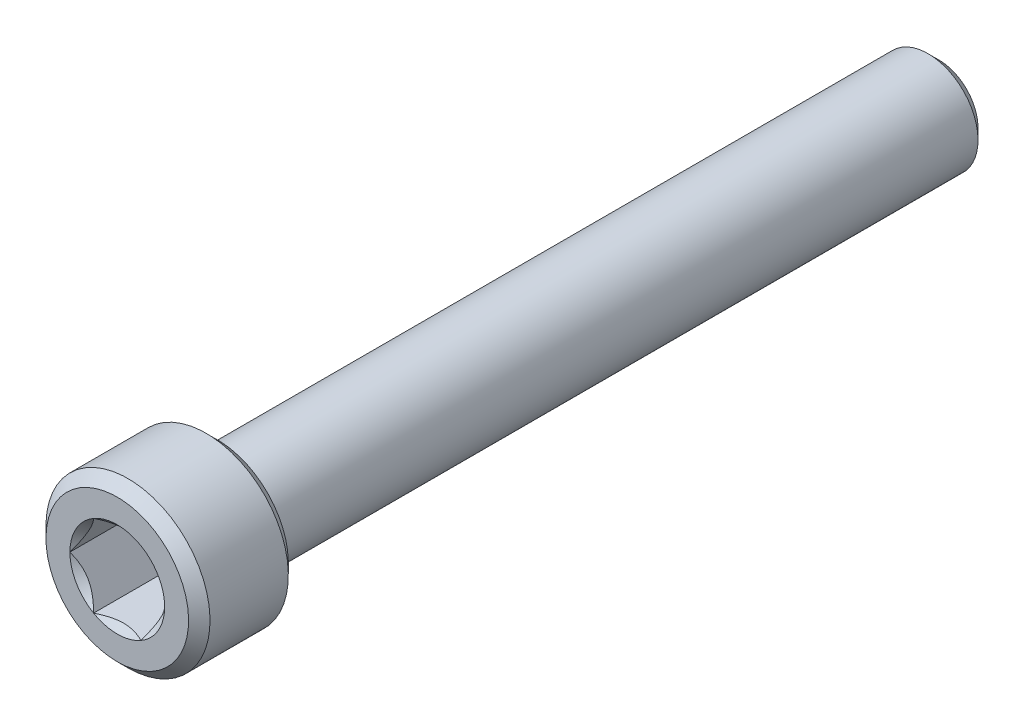
ISO-10303-21;
HEADER;
FILE_DESCRIPTION(('STEP AP214'),'2;1');
FILE_NAME('part.step','',(''),(''),'','','');
FILE_SCHEMA(('AUTOMOTIVE_DESIGN { 1 0 10303 214 1 1 1 1 }'));
ENDSEC;
DATA;
#1=APPLICATION_CONTEXT('core data for automotive mechanical design processes');
#2=APPLICATION_PROTOCOL_DEFINITION('international standard','automotive_design',2000,#1);
#3=PRODUCT_CONTEXT('',#1,'mechanical');
#4=PRODUCT('Part','Part','',(#3));
#5=PRODUCT_RELATED_PRODUCT_CATEGORY('part','',(#4));
#6=PRODUCT_DEFINITION_FORMATION('','',#4);
#7=PRODUCT_DEFINITION_CONTEXT('part definition',#1,'design');
#8=PRODUCT_DEFINITION('design','',#6,#7);
#9=PRODUCT_DEFINITION_SHAPE('','',#8);
#10=(LENGTH_UNIT() NAMED_UNIT(*) SI_UNIT(.MILLI.,.METRE.));
#11=(NAMED_UNIT(*) PLANE_ANGLE_UNIT() SI_UNIT($,.RADIAN.));
#12=(NAMED_UNIT(*) SI_UNIT($,.STERADIAN.) SOLID_ANGLE_UNIT());
#13=UNCERTAINTY_MEASURE_WITH_UNIT(LENGTH_MEASURE(1.E-05),#10,'distance_accuracy_value','');
#14=(GEOMETRIC_REPRESENTATION_CONTEXT(3) GLOBAL_UNCERTAINTY_ASSIGNED_CONTEXT((#13)) GLOBAL_UNIT_ASSIGNED_CONTEXT((#10,
#11,#12)) REPRESENTATION_CONTEXT('',''));
#15=CARTESIAN_POINT('',(0.,0.,0.));
#16=DIRECTION('',(0.,0.,1.));
#17=DIRECTION('',(1.,0.,0.));
#18=AXIS2_PLACEMENT_3D('',#15,#16,#17);
#19=CARTESIAN_POINT('',(0.,0.,14.6198166666666));
#20=DIRECTION('',(0.,0.,-1.));
#21=DIRECTION('',(0.,1.,0.));
#22=AXIS2_PLACEMENT_3D('',#19,#20,#21);
#23=CONICAL_SURFACE('',#22,3.96875,0.785398163397438);
#24=CARTESIAN_POINT('',(0.,0.,15.1384));
#25=DIRECTION('',(0.,0.,1.));
#26=DIRECTION('',(0.,-1.,0.));
#27=AXIS2_PLACEMENT_3D('',#24,#25,#26);
#28=CIRCLE('',#27,3.45016666666663);
#29=CARTESIAN_POINT('',(0.,-3.45016666666663,15.1384));
#30=VERTEX_POINT('',#29);
#31=EDGE_CURVE('E55',#30,#30,#28,.T.);
#32=ORIENTED_EDGE('',*,*,#31,.F.);
#33=EDGE_LOOP('',(#32));
#34=FACE_BOUND('',#33,.T.);
#35=CARTESIAN_POINT('',(0.,0.,14.6198166666666));
#36=DIRECTION('',(0.,0.,1.));
#37=DIRECTION('',(0.,-1.,0.));
#38=AXIS2_PLACEMENT_3D('',#35,#36,#37);
#39=CIRCLE('',#38,3.96875);
#40=CARTESIAN_POINT('',(0.,-3.96875,14.6198166666666));
#41=VERTEX_POINT('',#40);
#42=EDGE_CURVE('E154',#41,#41,#39,.T.);
#43=ORIENTED_EDGE('',*,*,#42,.T.);
#44=EDGE_LOOP('',(#43));
#45=FACE_BOUND('',#44,.T.);
#46=ADVANCED_FACE('F41',(#34,#45),#23,.T.);
#47=CARTESIAN_POINT('',(0.,3.45016666666663,15.1384));
#48=DIRECTION('',(0.,0.,-1.));
#49=DIRECTION('',(0.,1.,0.));
#50=AXIS2_PLACEMENT_3D('',#47,#48,#49);
#51=PLANE('',#50);
#52=CARTESIAN_POINT('',(0.,0.,15.1384));
#53=DIRECTION('',(0.,0.,1.));
#54=DIRECTION('',(1.,0.,0.));
#55=AXIS2_PLACEMENT_3D('',#52,#53,#54);
#56=CIRCLE('',#55,2.29135888084633);
#57=CARTESIAN_POINT('',(1.14567944042316,1.984375,15.1384));
#58=VERTEX_POINT('',#57);
#59=CARTESIAN_POINT('',(-1.14567944042316,1.984375,15.1384));
#60=VERTEX_POINT('',#59);
#61=EDGE_CURVE('E319',#58,#60,#56,.T.);
#62=ORIENTED_EDGE('',*,*,#61,.F.);
#63=CARTESIAN_POINT('',(2.29135888084633,0.,15.1384));
#64=VERTEX_POINT('',#63);
#65=EDGE_CURVE('E264',#64,#58,#56,.T.);
#66=ORIENTED_EDGE('',*,*,#65,.F.);
#67=CARTESIAN_POINT('',(1.14567944042316,-1.984375,15.1384));
#68=VERTEX_POINT('',#67);
#69=EDGE_CURVE('E61',#68,#64,#56,.T.);
#70=ORIENTED_EDGE('',*,*,#69,.F.);
#71=CARTESIAN_POINT('',(-1.14567944042317,-1.984375,15.1384));
#72=VERTEX_POINT('',#71);
#73=EDGE_CURVE('E68',#72,#68,#56,.T.);
#74=ORIENTED_EDGE('',*,*,#73,.F.);
#75=CARTESIAN_POINT('',(-2.29135888084633,0.,15.1384));
#76=VERTEX_POINT('',#75);
#77=EDGE_CURVE('E311',#76,#72,#56,.T.);
#78=ORIENTED_EDGE('',*,*,#77,.F.);
#79=EDGE_CURVE('E316',#60,#76,#56,.T.);
#80=ORIENTED_EDGE('',*,*,#79,.F.);
#81=EDGE_LOOP('',(#62,#66,#70,#74,#78,#80));
#82=FACE_BOUND('',#81,.T.);
#83=ORIENTED_EDGE('',*,*,#31,.T.);
#84=EDGE_LOOP('',(#83));
#85=FACE_BOUND('',#84,.T.);
#86=ADVANCED_FACE('F195',(#82,#85),#51,.F.);
#87=CARTESIAN_POINT('',(0.,0.,-24.6126));
#88=DIRECTION('',(0.,0.,1.));
#89=DIRECTION('',(0.,-1.,0.));
#90=AXIS2_PLACEMENT_3D('',#87,#88,#89);
#91=PLANE('',#90);
#92=CARTESIAN_POINT('',(0.,0.,-24.6126));
#93=DIRECTION('',(0.,0.,1.));
#94=DIRECTION('',(0.,-1.,0.));
#95=AXIS2_PLACEMENT_3D('',#92,#93,#94);
#96=CIRCLE('',#95,1.89441666666655);
#97=CARTESIAN_POINT('',(0.,-1.89441666666655,-24.6126));
#98=VERTEX_POINT('',#97);
#99=EDGE_CURVE('E188',#98,#98,#96,.T.);
#100=ORIENTED_EDGE('',*,*,#99,.F.);
#101=EDGE_LOOP('',(#100));
#102=FACE_BOUND('',#101,.T.);
#103=ADVANCED_FACE('F229',(#102),#91,.F.);
#104=CARTESIAN_POINT('',(0.,0.,-24.6126));
#105=DIRECTION('',(0.,0.,1.));
#106=DIRECTION('',(0.,-1.,0.));
#107=AXIS2_PLACEMENT_3D('',#104,#105,#106);
#108=CONICAL_SURFACE('',#107,1.89441666666655,0.785398163397442);
#109=CARTESIAN_POINT('',(0.,0.,-24.0940166666666));
#110=DIRECTION('',(0.,0.,1.));
#111=DIRECTION('',(0.,-1.,0.));
#112=AXIS2_PLACEMENT_3D('',#109,#110,#111);
#113=CIRCLE('',#112,2.41299999999991);
#114=CARTESIAN_POINT('',(0.,-2.41299999999991,-24.0940166666666));
#115=VERTEX_POINT('',#114);
#116=EDGE_CURVE('E184',#115,#115,#113,.T.);
#117=ORIENTED_EDGE('',*,*,#116,.F.);
#118=EDGE_LOOP('',(#117));
#119=FACE_BOUND('',#118,.T.);
#120=ORIENTED_EDGE('',*,*,#99,.T.);
#121=EDGE_LOOP('',(#120));
#122=FACE_BOUND('',#121,.T.);
#123=ADVANCED_FACE('F223',(#119,#122),#108,.T.);
#124=CARTESIAN_POINT('',(0.,0.,10.3124));
#125=DIRECTION('',(0.,0.,1.));
#126=DIRECTION('',(0.,-1.,0.));
#127=AXIS2_PLACEMENT_3D('',#124,#125,#126);
#128=CYLINDRICAL_SURFACE('',#127,2.4129999999999);
#129=CARTESIAN_POINT('',(0.,0.,10.3124));
#130=DIRECTION('',(0.,0.,1.));
#131=DIRECTION('',(0.,-1.,0.));
#132=AXIS2_PLACEMENT_3D('',#129,#130,#131);
#133=CIRCLE('',#132,2.4129999999999);
#134=CARTESIAN_POINT('',(0.,-2.4129999999999,10.3124));
#135=VERTEX_POINT('',#134);
#136=EDGE_CURVE('E180',#135,#135,#133,.T.);
#137=ORIENTED_EDGE('',*,*,#136,.F.);
#138=EDGE_LOOP('',(#137));
#139=FACE_BOUND('',#138,.T.);
#140=ORIENTED_EDGE('',*,*,#116,.T.);
#141=EDGE_LOOP('',(#140));
#142=FACE_BOUND('',#141,.T.);
#143=ADVANCED_FACE('F217',(#139,#142),#128,.T.);
#144=CARTESIAN_POINT('',(0.,3.45016666666667,10.3124));
#145=DIRECTION('',(0.,0.,1.));
#146=DIRECTION('',(0.,-1.,0.));
#147=AXIS2_PLACEMENT_3D('',#144,#145,#146);
#148=PLANE('',#147);
#149=CARTESIAN_POINT('',(0.,0.,10.3124));
#150=DIRECTION('',(0.,0.,1.));
#151=DIRECTION('',(0.,-1.,0.));
#152=AXIS2_PLACEMENT_3D('',#149,#150,#151);
#153=CIRCLE('',#152,3.45016666666667);
#154=CARTESIAN_POINT('',(0.,-3.45016666666667,10.3124));
#155=VERTEX_POINT('',#154);
#156=EDGE_CURVE('E176',#155,#155,#153,.T.);
#157=ORIENTED_EDGE('',*,*,#156,.F.);
#158=EDGE_LOOP('',(#157));
#159=FACE_BOUND('',#158,.T.);
#160=ORIENTED_EDGE('',*,*,#136,.T.);
#161=EDGE_LOOP('',(#160));
#162=FACE_BOUND('',#161,.T.);
#163=ADVANCED_FACE('F211',(#159,#162),#148,.F.);
#164=CARTESIAN_POINT('',(0.,0.,10.3124));
#165=DIRECTION('',(0.,0.,1.));
#166=DIRECTION('',(0.,-1.,0.));
#167=AXIS2_PLACEMENT_3D('',#164,#165,#166);
#168=CONICAL_SURFACE('',#167,3.45016666666667,0.785398163397409);
#169=CARTESIAN_POINT('',(0.,0.,10.8309833333334));
#170=DIRECTION('',(0.,0.,1.));
#171=DIRECTION('',(0.,-1.,0.));
#172=AXIS2_PLACEMENT_3D('',#169,#170,#171);
#173=CIRCLE('',#172,3.96875);
#174=CARTESIAN_POINT('',(0.,-3.96875,10.8309833333334));
#175=VERTEX_POINT('',#174);
#176=EDGE_CURVE('E172',#175,#175,#173,.T.);
#177=ORIENTED_EDGE('',*,*,#176,.F.);
#178=EDGE_LOOP('',(#177));
#179=FACE_BOUND('',#178,.T.);
#180=ORIENTED_EDGE('',*,*,#156,.T.);
#181=EDGE_LOOP('',(#180));
#182=FACE_BOUND('',#181,.T.);
#183=ADVANCED_FACE('F205',(#179,#182),#168,.T.);
#184=CARTESIAN_POINT('',(0.,0.,10.3124));
#185=DIRECTION('',(0.,0.,1.));
#186=DIRECTION('',(0.,-1.,0.));
#187=AXIS2_PLACEMENT_3D('',#184,#185,#186);
#188=CYLINDRICAL_SURFACE('',#187,3.96875);
#189=ORIENTED_EDGE('',*,*,#42,.F.);
#190=EDGE_LOOP('',(#189));
#191=FACE_BOUND('',#190,.T.);
#192=ORIENTED_EDGE('',*,*,#176,.T.);
#193=EDGE_LOOP('',(#192));
#194=FACE_BOUND('',#193,.T.);
#195=ADVANCED_FACE('F201',(#191,#194),#188,.T.);
#196=CARTESIAN_POINT('',(0.,0.,15.1384));
#197=DIRECTION('',(0.,0.,1.));
#198=DIRECTION('',(1.,0.,0.));
#199=AXIS2_PLACEMENT_3D('',#196,#197,#198);
#200=CONICAL_SURFACE('',#199,2.29135888084633,0.78539816339745);
#201=ORIENTED_EDGE('',*,*,#61,.T.);
#202=CARTESIAN_POINT('',(-2.28495242157822,1.984375,15.8733840788166));
#203=CARTESIAN_POINT('',(-2.22931635455402,1.984375,15.8313866855508));
#204=CARTESIAN_POINT('',(-2.17336876548389,1.984375,15.7897960540763));
#205=CARTESIAN_POINT('',(-2.06072770258171,1.984375,15.7076084614715));
#206=CARTESIAN_POINT('',(-2.00403404503435,1.984375,15.667011752405));
#207=CARTESIAN_POINT('',(-1.88936329173488,1.984375,15.5867035031747));
#208=CARTESIAN_POINT('',(-1.83137965519348,1.984375,15.5470012588133));
#209=CARTESIAN_POINT('',(-1.7144280213784,1.984375,15.4690851734013));
#210=CARTESIAN_POINT('',(-1.65546009407227,1.984375,15.4308712271944));
#211=CARTESIAN_POINT('',(-1.47005472306035,1.984375,15.3146528340136));
#212=CARTESIAN_POINT('',(-1.34163909427883,1.984375,15.2397478868724));
#213=CARTESIAN_POINT('',(-1.0784038470548,1.984375,15.1027302154397));
#214=CARTESIAN_POINT('',(-0.943607781407425,1.984375,15.0405743664824));
#215=CARTESIAN_POINT('',(-0.741275100444882,1.984375,14.9645325786886));
#216=CARTESIAN_POINT('',(-0.676735408881095,1.984375,14.942708061326));
#217=CARTESIAN_POINT('',(-0.546098118112762,1.984375,14.9042404635378));
#218=CARTESIAN_POINT('',(-0.480000411919956,1.984375,14.8875977400655));
#219=CARTESIAN_POINT('',(-0.347746170028532,1.984375,14.8606353808697));
#220=CARTESIAN_POINT('',(-0.281612071479123,1.984375,14.8502074097359));
#221=CARTESIAN_POINT('',(-0.148636620052351,1.984375,14.8358781473766));
#222=CARTESIAN_POINT('',(-0.0817953907393243,1.984375,14.8319757342274));
#223=CARTESIAN_POINT('',(0.0495156750890641,1.984375,14.8309870513327));
#224=CARTESIAN_POINT('',(0.113983775102991,1.984375,14.833659178875));
#225=CARTESIAN_POINT('',(0.242367515846177,1.984375,14.8451392104975));
#226=CARTESIAN_POINT('',(0.306283102295919,1.984375,14.8539477106392));
#227=CARTESIAN_POINT('',(0.434181040262184,1.984375,14.8773690213329));
#228=CARTESIAN_POINT('',(0.498145026858309,1.984375,14.8920806062321));
#229=CARTESIAN_POINT('',(0.624675616953007,1.984375,14.9265261814121));
#230=CARTESIAN_POINT('',(0.687242336899688,1.984375,14.9462597514492));
#231=CARTESIAN_POINT('',(0.884225483826088,1.984375,15.0158122372308));
#232=CARTESIAN_POINT('',(1.01583674256468,1.984375,15.0735524112565));
#233=CARTESIAN_POINT('',(1.27288659242652,1.984375,15.2019303365888));
#234=CARTESIAN_POINT('',(1.3983008827048,1.984375,15.2726144249194));
#235=CARTESIAN_POINT('',(1.57956687990221,1.984375,15.3829166638132));
#236=CARTESIAN_POINT('',(1.63738271299424,1.984375,15.4193698294754));
#237=CARTESIAN_POINT('',(1.75202215386202,1.984375,15.4938159632917));
#238=CARTESIAN_POINT('',(1.80884568601362,1.984375,15.5318090480781));
#239=CARTESIAN_POINT('',(1.92116923084255,1.984375,15.6087388088931));
#240=CARTESIAN_POINT('',(1.97667624512253,1.984375,15.6476653130388));
#241=CARTESIAN_POINT('',(2.08693170717166,1.984375,15.7265477461214));
#242=CARTESIAN_POINT('',(2.14168035934793,1.984375,15.766503389024));
#243=CARTESIAN_POINT('',(2.19611149046622,1.984375,15.8068806112854));
#244=B_SPLINE_CURVE_WITH_KNOTS('',3,(#202,#203,#204,#205,#206,#207,#208,#209,#210,#211,#212,
#213,#214,#215,#216,#217,#218,#219,#220,#221,#222,#223,#224,#225,#226,#227,#228,#229,#230,#231,
#232,#233,#234,#235,#236,#237,#238,#239,#240,#241,#242,#243),.UNSPECIFIED.,.F.,.F.,(4,2,2,2,2,2,
2,2,2,2,2,2,2,2,2,2,2,2,2,2,4),(0.,0.209126070008323,0.418304637356568,0.629103979977991,
0.839888401371184,1.28549951116127,1.72957750768351,1.93379389749971,2.13802435186698,
2.33858179514333,2.53910475350639,2.73236963400794,2.92565329006886,3.12231577097487,
3.31896180041345,3.74886295245172,4.18033428125362,4.3853601718029,4.59040161996382,
4.79377749165107,4.99709743524131),.UNSPECIFIED.);
#245=EDGE_CURVE('E11',#58,#60,#244,.F.);
#246=ORIENTED_EDGE('',*,*,#245,.F.);
#247=EDGE_LOOP('',(#201,#246));
#248=FACE_BOUND('',#247,.T.);
#249=ADVANCED_FACE('F204',(#248),#200,.F.);
#250=ORIENTED_EDGE('',*,*,#79,.T.);
#251=CARTESIAN_POINT('',(-1.14556397036933,1.984575,15.1385154787818));
#252=CARTESIAN_POINT('',(-1.18494849354192,1.9163590048332,15.0991628522639));
#253=CARTESIAN_POINT('',(-1.22499159714897,1.84700231489304,15.0621213104462));
#254=CARTESIAN_POINT('',(-1.30664400291398,1.70557619954781,14.9942988584233));
#255=CARTESIAN_POINT('',(-1.34826107209555,1.63349332126322,14.9635556890918));
#256=CARTESIAN_POINT('',(-1.43217992591557,1.488141602734,14.9108918888112));
#257=CARTESIAN_POINT('',(-1.47446033414662,1.41490978751306,14.88883887588));
#258=CARTESIAN_POINT('',(-1.55995203534886,1.2668338174053,14.8548614929439));
#259=CARTESIAN_POINT('',(-1.60316071596705,1.19199418724658,14.8429117560917));
#260=CARTESIAN_POINT('',(-1.6776271237807,1.06301458545619,14.8321300990819));
#261=CARTESIAN_POINT('',(-1.7087886237741,1.00904128422756,14.8305338990591));
#262=CARTESIAN_POINT('',(-1.77106070163465,0.901182881480202,14.8332218388653));
#263=CARTESIAN_POINT('',(-1.80217125782056,0.847297817514479,14.8375080403405));
#264=CARTESIAN_POINT('',(-1.86409863044402,0.740036461751399,14.8517168730135));
#265=CARTESIAN_POINT('',(-1.89491507894443,0.686660807239862,14.8616458104523));
#266=CARTESIAN_POINT('',(-1.95601509066827,0.580832482591106,14.8865950842745));
#267=CARTESIAN_POINT('',(-1.9862986945516,0.528379742028901,14.9016150303895));
#268=CARTESIAN_POINT('',(-2.06387267818152,0.394017661036354,14.9462078516357));
#269=CARTESIAN_POINT('',(-2.11068193911104,0.312941642841678,14.9791429959383));
#270=CARTESIAN_POINT('',(-2.17951072233758,0.193726693270161,15.0347424412022));
#271=CARTESIAN_POINT('',(-2.20219286161692,0.154440075613999,15.0542775920519));
#272=CARTESIAN_POINT('',(-2.24713694590237,0.0765946381319467,15.0951287381194));
#273=CARTESIAN_POINT('',(-2.26939913882716,0.0380353888983009,15.1164436395683));
#274=CARTESIAN_POINT('',(-2.29147435090017,-0.000200000000000228,15.1385154787818));
#275=B_SPLINE_CURVE_WITH_KNOTS('',3,(#251,#252,#253,#254,#255,#256,#257,#258,#259,#260,#261,
#262,#263,#264,#265,#266,#267,#268,#269,#270,#271,#272,#273,#274),.UNSPECIFIED.,.F.,.F.,(4,2,2,
2,2,2,2,2,2,2,2,4),(0.,0.264339630306625,0.530219665093692,0.791876416371458,1.05287424418109,
1.239639843932,1.42647091743852,1.61351120244034,1.8005371524754,2.09764209964316,
2.24579179873714,2.39385111134157),.UNSPECIFIED.);
#276=EDGE_CURVE('E254',#60,#76,#275,.T.);
#277=ORIENTED_EDGE('',*,*,#276,.F.);
#278=EDGE_LOOP('',(#250,#277));
#279=FACE_BOUND('',#278,.T.);
#280=ADVANCED_FACE('F326',(#279),#200,.F.);
#281=ORIENTED_EDGE('',*,*,#77,.T.);
#282=CARTESIAN_POINT('',(-2.29147435090017,0.000200000000000176,15.1385154787818));
#283=CARTESIAN_POINT('',(-2.25208982772758,-0.0680159951668019,15.0991628522639));
#284=CARTESIAN_POINT('',(-2.21204672412052,-0.137372685106965,15.0621213104462));
#285=CARTESIAN_POINT('',(-2.13039431835551,-0.278798800452187,14.9942988584233));
#286=CARTESIAN_POINT('',(-2.08877724917394,-0.350881678736782,14.9635556890918));
#287=CARTESIAN_POINT('',(-2.00485839535392,-0.496233397266004,14.9108918888112));
#288=CARTESIAN_POINT('',(-1.96257798712287,-0.569465212486938,14.88883887588));
#289=CARTESIAN_POINT('',(-1.87708628592063,-0.717541182594706,14.8548614929439));
#290=CARTESIAN_POINT('',(-1.83387760530244,-0.792380812753424,14.8429117560917));
#291=CARTESIAN_POINT('',(-1.75941119748879,-0.921360414543815,14.8321300990819));
#292=CARTESIAN_POINT('',(-1.72824969749539,-0.975333715772442,14.8305338990591));
#293=CARTESIAN_POINT('',(-1.66597761963484,-1.0831921185198,14.8332218388653));
#294=CARTESIAN_POINT('',(-1.63486706344893,-1.13707718248552,14.8375080403405));
#295=CARTESIAN_POINT('',(-1.57293969082547,-1.2443385382486,14.8517168730135));
#296=CARTESIAN_POINT('',(-1.54212324232506,-1.29771419276014,14.8616458104523));
#297=CARTESIAN_POINT('',(-1.48102323060122,-1.4035425174089,14.8865950842745));
#298=CARTESIAN_POINT('',(-1.4507396267179,-1.4559952579711,14.9016150303895));
#299=CARTESIAN_POINT('',(-1.37316564308797,-1.59035733896365,14.9462078516357));
#300=CARTESIAN_POINT('',(-1.32635638215845,-1.67143335715832,14.9791429959383));
#301=CARTESIAN_POINT('',(-1.25752759893191,-1.79064830672984,15.0347424412022));
#302=CARTESIAN_POINT('',(-1.23484545965257,-1.829934924386,15.0542775920519));
#303=CARTESIAN_POINT('',(-1.18990137536713,-1.90778036186805,15.0951287381194));
#304=CARTESIAN_POINT('',(-1.16763918244233,-1.9463396111017,15.1164436395683));
#305=CARTESIAN_POINT('',(-1.14556397036933,-1.984575,15.1385154787818));
#306=B_SPLINE_CURVE_WITH_KNOTS('',3,(#282,#283,#284,#285,#286,#287,#288,#289,#290,#291,#292,
#293,#294,#295,#296,#297,#298,#299,#300,#301,#302,#303,#304,#305),.UNSPECIFIED.,.F.,.F.,(4,2,2,
2,2,2,2,2,2,2,2,4),(0.,0.264339630306626,0.530219665093694,0.79187641637146,1.05287424418109,
1.239639843932,1.42647091743852,1.61351120244035,1.8005371524754,2.09764209964316,
2.24579179873714,2.39385111134157),.UNSPECIFIED.);
#307=EDGE_CURVE('E263',#76,#72,#306,.T.);
#308=ORIENTED_EDGE('',*,*,#307,.F.);
#309=EDGE_LOOP('',(#281,#308));
#310=FACE_BOUND('',#309,.T.);
#311=ADVANCED_FACE('F328',(#310),#200,.F.);
#312=ORIENTED_EDGE('',*,*,#73,.T.);
#313=CARTESIAN_POINT('',(-2.28495242191068,-1.984375,15.8733840790676));
#314=CARTESIAN_POINT('',(-2.22931635487714,-1.984375,15.8313866857921));
#315=CARTESIAN_POINT('',(-2.17336876579766,-1.984375,15.789796054308));
#316=CARTESIAN_POINT('',(-2.06072770287667,-1.984375,15.7076084616839));
#317=CARTESIAN_POINT('',(-2.00403404531986,-1.984375,15.6670117526079));
#318=CARTESIAN_POINT('',(-1.88936329200117,-1.984375,15.5867035033582));
#319=CARTESIAN_POINT('',(-1.83137965544999,-1.984375,15.5470012589872));
#320=CARTESIAN_POINT('',(-1.71442802161519,-1.984375,15.469085173556));
#321=CARTESIAN_POINT('',(-1.65546009429911,-1.984375,15.4308712273396));
#322=CARTESIAN_POINT('',(-1.47005472325436,-1.984375,15.3146528341287));
#323=CARTESIAN_POINT('',(-1.3416390944495,-1.984375,15.2397478869673));
#324=CARTESIAN_POINT('',(-1.07840384717679,-1.984375,15.1027302154972));
#325=CARTESIAN_POINT('',(-0.943607781504099,-1.984375,15.0405743665226));
#326=CARTESIAN_POINT('',(-0.74127510052251,-1.984375,14.964532578716));
#327=CARTESIAN_POINT('',(-0.676735408966699,-1.984375,14.9427080613539));
#328=CARTESIAN_POINT('',(-0.546098118214577,-1.984375,14.9042404635651));
#329=CARTESIAN_POINT('',(-0.480000412030008,-1.984375,14.8875977400917));
#330=CARTESIAN_POINT('',(-0.347746170154786,-1.984375,14.8606353808918));
#331=CARTESIAN_POINT('',(-0.281612071613337,-1.984375,14.850207409755));
#332=CARTESIAN_POINT('',(-0.14863662020222,-1.984375,14.8358781473881));
#333=CARTESIAN_POINT('',(-0.0817953908968883,-1.984375,14.8319757342341));
#334=CARTESIAN_POINT('',(0.049515674917303,-1.984375,14.8309870513286));
#335=CARTESIAN_POINT('',(0.113983774924708,-1.984375,14.833659178865));
#336=CARTESIAN_POINT('',(0.242367515655502,-1.984375,14.8451392104746));
#337=CARTESIAN_POINT('',(0.306283102099375,-1.984375,14.8539477106093));
#338=CARTESIAN_POINT('',(0.434181040054052,-1.984375,14.8773690212885));
#339=CARTESIAN_POINT('',(0.498145026644477,-1.984375,14.8920806061801));
#340=CARTESIAN_POINT('',(0.624675616728325,-1.984375,14.9265261813447));
#341=CARTESIAN_POINT('',(0.687242336669856,-1.984375,14.946259751374));
#342=CARTESIAN_POINT('',(0.88422548354621,-1.984375,15.0158122371188));
#343=CARTESIAN_POINT('',(1.01583674224241,-1.984375,15.0735524111108));
#344=CARTESIAN_POINT('',(1.27288659202273,-1.984375,15.2019303363718));
#345=CARTESIAN_POINT('',(1.3983008822619,-1.984375,15.2726144246649));
#346=CARTESIAN_POINT('',(1.57956687940503,-1.984375,15.3829166635036));
#347=CARTESIAN_POINT('',(1.63738271248118,-1.984375,15.4193698291489));
#348=CARTESIAN_POINT('',(1.75202215331741,-1.984375,15.4938159629313));
#349=CARTESIAN_POINT('',(1.80884568545336,-1.984375,15.5318090477007));
#350=CARTESIAN_POINT('',(1.92116923025136,-1.984375,15.6087388084819));
#351=CARTESIAN_POINT('',(1.97667624451606,-1.984375,15.6476653126108));
#352=CARTESIAN_POINT('',(2.08693170653472,-1.984375,15.7265477456598));
#353=CARTESIAN_POINT('',(2.1416803586958,-1.984375,15.7665033885457));
#354=CARTESIAN_POINT('',(2.19611148979895,-1.984375,15.8068806107903));
#355=B_SPLINE_CURVE_WITH_KNOTS('',3,(#313,#314,#315,#316,#317,#318,#319,#320,#321,#322,#323,
#324,#325,#326,#327,#328,#329,#330,#331,#332,#333,#334,#335,#336,#337,#338,#339,#340,#341,#342,
#343,#344,#345,#346,#347,#348,#349,#350,#351,#352,#353,#354),.UNSPECIFIED.,.F.,.F.,(4,2,2,2,2,2,
2,2,2,2,2,2,2,2,2,2,2,2,2,2,4),(0.,0.209126070048126,0.418304637436192,0.629103980098179,
0.839888401531931,1.28549951141299,1.72957750802534,1.93379389781848,2.13802435216272,
2.33858179541699,2.53910475375796,2.7323696342393,2.92565329027999,3.12231577116422,
3.31896180058103,3.74886295246281,4.18033428110719,4.38536017158909,4.59040161968262,
4.7937774913034,4.99709743482717),.UNSPECIFIED.);
#356=EDGE_CURVE('E282',#72,#68,#355,.T.);
#357=ORIENTED_EDGE('',*,*,#356,.F.);
#358=EDGE_LOOP('',(#312,#357));
#359=FACE_BOUND('',#358,.T.);
#360=ADVANCED_FACE('F331',(#359),#200,.F.);
#361=ORIENTED_EDGE('',*,*,#69,.T.);
#362=CARTESIAN_POINT('',(1.14556397036932,-1.984575,15.1385154787818));
#363=CARTESIAN_POINT('',(1.18494849354192,-1.9163590048332,15.0991628522639));
#364=CARTESIAN_POINT('',(1.22499159714897,-1.84700231489303,15.0621213104462));
#365=CARTESIAN_POINT('',(1.30664400291398,-1.70557619954781,14.9942988584233));
#366=CARTESIAN_POINT('',(1.34826107209555,-1.63349332126322,14.9635556890917));
#367=CARTESIAN_POINT('',(1.43217992591557,-1.488141602734,14.9108918888112));
#368=CARTESIAN_POINT('',(1.47446033414662,-1.41490978751306,14.88883887588));
#369=CARTESIAN_POINT('',(1.55995203534886,-1.2668338174053,14.8548614929439));
#370=CARTESIAN_POINT('',(1.60316071596705,-1.19199418724658,14.8429117560917));
#371=CARTESIAN_POINT('',(1.6776271237807,-1.06301458545619,14.8321300990819));
#372=CARTESIAN_POINT('',(1.7087886237741,-1.00904128422756,14.8305338990591));
#373=CARTESIAN_POINT('',(1.77106070163465,-0.901182881480202,14.8332218388653));
#374=CARTESIAN_POINT('',(1.80217125782056,-0.847297817514479,14.8375080403405));
#375=CARTESIAN_POINT('',(1.86409863044402,-0.740036461751399,14.8517168730135));
#376=CARTESIAN_POINT('',(1.89491507894443,-0.686660807239863,14.8616458104523));
#377=CARTESIAN_POINT('',(1.95601509066827,-0.580832482591107,14.8865950842745));
#378=CARTESIAN_POINT('',(1.9862986945516,-0.528379742028901,14.9016150303895));
#379=CARTESIAN_POINT('',(2.06387267818152,-0.394017661036354,14.9462078516357));
#380=CARTESIAN_POINT('',(2.11068193911104,-0.312941642841678,14.9791429959383));
#381=CARTESIAN_POINT('',(2.17951072233758,-0.193726693270162,15.0347424412022));
#382=CARTESIAN_POINT('',(2.20219286161692,-0.154440075614,15.0542775920519));
#383=CARTESIAN_POINT('',(2.24713694590237,-0.0765946381319474,15.0951287381194));
#384=CARTESIAN_POINT('',(2.26939913882716,-0.0380353888983016,15.1164436395683));
#385=CARTESIAN_POINT('',(2.29147435090017,0.000199999999999533,15.1385154787818));
#386=B_SPLINE_CURVE_WITH_KNOTS('',3,(#362,#363,#364,#365,#366,#367,#368,#369,#370,#371,#372,
#373,#374,#375,#376,#377,#378,#379,#380,#381,#382,#383,#384,#385),.UNSPECIFIED.,.F.,.F.,(4,2,2,
2,2,2,2,2,2,2,2,4),(0.,0.264339630306626,0.530219665093694,0.79187641637146,1.05287424418109,
1.239639843932,1.42647091743852,1.61351120244034,1.8005371524754,2.09764209964316,
2.24579179873714,2.39385111134157),.UNSPECIFIED.);
#387=EDGE_CURVE('E131',#68,#64,#386,.T.);
#388=ORIENTED_EDGE('',*,*,#387,.F.);
#389=EDGE_LOOP('',(#361,#388));
#390=FACE_BOUND('',#389,.T.);
#391=ADVANCED_FACE('F274',(#390),#200,.F.);
#392=ORIENTED_EDGE('',*,*,#65,.T.);
#393=CARTESIAN_POINT('',(2.29147435090017,-0.000200000000000406,15.1385154787818));
#394=CARTESIAN_POINT('',(2.25208982772757,0.0680159951668017,15.0991628522639));
#395=CARTESIAN_POINT('',(2.21204672412052,0.137372685106965,15.0621213104462));
#396=CARTESIAN_POINT('',(2.13039431835551,0.278798800452187,14.9942988584233));
#397=CARTESIAN_POINT('',(2.08877724917394,0.350881678736782,14.9635556890918));
#398=CARTESIAN_POINT('',(2.00485839535392,0.496233397266003,14.9108918888112));
#399=CARTESIAN_POINT('',(1.96257798712287,0.569465212486938,14.88883887588));
#400=CARTESIAN_POINT('',(1.87708628592063,0.717541182594706,14.8548614929439));
#401=CARTESIAN_POINT('',(1.83387760530244,0.792380812753424,14.8429117560917));
#402=CARTESIAN_POINT('',(1.75941119748879,0.921360414543816,14.8321300990819));
#403=CARTESIAN_POINT('',(1.72824969749539,0.975333715772442,14.8305338990591));
#404=CARTESIAN_POINT('',(1.66597761963484,1.0831921185198,14.8332218388653));
#405=CARTESIAN_POINT('',(1.63486706344893,1.13707718248552,14.8375080403405));
#406=CARTESIAN_POINT('',(1.57293969082547,1.2443385382486,14.8517168730135));
#407=CARTESIAN_POINT('',(1.54212324232506,1.29771419276014,14.8616458104523));
#408=CARTESIAN_POINT('',(1.48102323060122,1.4035425174089,14.8865950842745));
#409=CARTESIAN_POINT('',(1.45073962671789,1.4559952579711,14.9016150303895));
#410=CARTESIAN_POINT('',(1.37316564308797,1.59035733896365,14.9462078516357));
#411=CARTESIAN_POINT('',(1.32635638215845,1.67143335715832,14.9791429959383));
#412=CARTESIAN_POINT('',(1.25752759893191,1.79064830672984,15.0347424412022));
#413=CARTESIAN_POINT('',(1.23484545965257,1.829934924386,15.0542775920519));
#414=CARTESIAN_POINT('',(1.18990137536712,1.90778036186805,15.0951287381194));
#415=CARTESIAN_POINT('',(1.16763918244233,1.9463396111017,15.1164436395683));
#416=CARTESIAN_POINT('',(1.14556397036933,1.984575,15.1385154787818));
#417=B_SPLINE_CURVE_WITH_KNOTS('',3,(#393,#394,#395,#396,#397,#398,#399,#400,#401,#402,#403,
#404,#405,#406,#407,#408,#409,#410,#411,#412,#413,#414,#415,#416),.UNSPECIFIED.,.F.,.F.,(4,2,2,
2,2,2,2,2,2,2,2,4),(0.,0.264339630306627,0.530219665093694,0.791876416371461,1.05287424418109,
1.239639843932,1.42647091743852,1.61351120244035,1.8005371524754,2.09764209964316,
2.24579179873714,2.39385111134157),.UNSPECIFIED.);
#418=EDGE_CURVE('E108',#64,#58,#417,.T.);
#419=ORIENTED_EDGE('',*,*,#418,.F.);
#420=EDGE_LOOP('',(#392,#419));
#421=FACE_BOUND('',#420,.T.);
#422=ADVANCED_FACE('F270',(#421),#200,.F.);
#423=CARTESIAN_POINT('',(0.,0.,11.5189));
#424=DIRECTION('',(0.,0.,1.));
#425=DIRECTION('',(1.,0.,0.));
#426=AXIS2_PLACEMENT_3D('',#423,#424,#425);
#427=PLANE('',#426);
#428=DIRECTION('',(-0.5,0.866025403784438,0.));
#429=VECTOR('',#428,1.);
#430=CARTESIAN_POINT('',(2.29135888084633,0.,11.5189));
#431=LINE('',#430,#429);
#432=CARTESIAN_POINT('',(2.29135888084633,0.,11.5189));
#433=VERTEX_POINT('',#432);
#434=CARTESIAN_POINT('',(1.14567944042316,1.984375,11.5189));
#435=VERTEX_POINT('',#434);
#436=EDGE_CURVE('E106',#433,#435,#431,.T.);
#437=ORIENTED_EDGE('',*,*,#436,.T.);
#438=DIRECTION('',(-1.,0.,0.));
#439=VECTOR('',#438,1.);
#440=CARTESIAN_POINT('',(1.14567944042316,1.984375,11.5189));
#441=LINE('',#440,#439);
#442=CARTESIAN_POINT('',(-1.14567944042316,1.984375,11.5189));
#443=VERTEX_POINT('',#442);
#444=EDGE_CURVE('E116',#435,#443,#441,.T.);
#445=ORIENTED_EDGE('',*,*,#444,.T.);
#446=DIRECTION('',(-0.5,-0.866025403784438,0.));
#447=VECTOR('',#446,1.);
#448=CARTESIAN_POINT('',(-1.14567944042316,1.984375,11.5189));
#449=LINE('',#448,#447);
#450=CARTESIAN_POINT('',(-2.29135888084633,0.,11.5189));
#451=VERTEX_POINT('',#450);
#452=EDGE_CURVE('E123',#443,#451,#449,.T.);
#453=ORIENTED_EDGE('',*,*,#452,.T.);
#454=DIRECTION('',(0.5,-0.866025403784439,0.));
#455=VECTOR('',#454,1.);
#456=CARTESIAN_POINT('',(-2.29135888084633,0.,11.5189));
#457=LINE('',#456,#455);
#458=CARTESIAN_POINT('',(-1.14567944042317,-1.984375,11.5189));
#459=VERTEX_POINT('',#458);
#460=EDGE_CURVE('E142',#451,#459,#457,.T.);
#461=ORIENTED_EDGE('',*,*,#460,.T.);
#462=DIRECTION('',(1.,0.,0.));
#463=VECTOR('',#462,1.);
#464=CARTESIAN_POINT('',(-1.14567944042317,-1.984375,11.5189));
#465=LINE('',#464,#463);
#466=CARTESIAN_POINT('',(1.14567944042316,-1.984375,11.5189));
#467=VERTEX_POINT('',#466);
#468=EDGE_CURVE('E146',#459,#467,#465,.T.);
#469=ORIENTED_EDGE('',*,*,#468,.T.);
#470=DIRECTION('',(0.500000000000001,0.866025403784438,0.));
#471=VECTOR('',#470,1.);
#472=CARTESIAN_POINT('',(1.14567944042316,-1.984375,11.5189));
#473=LINE('',#472,#471);
#474=EDGE_CURVE('E113',#467,#433,#473,.T.);
#475=ORIENTED_EDGE('',*,*,#474,.T.);
#476=EDGE_LOOP('',(#437,#445,#453,#461,#469,#475));
#477=FACE_BOUND('',#476,.T.);
#478=ADVANCED_FACE('F125',(#477),#427,.T.);
#479=CARTESIAN_POINT('',(1.14567944042316,1.984375,11.5189));
#480=DIRECTION('',(0.,1.,0.));
#481=DIRECTION('',(-1.,0.,0.));
#482=AXIS2_PLACEMENT_3D('',#479,#480,#481);
#483=PLANE('',#482);
#484=DIRECTION('',(0.,0.,1.));
#485=VECTOR('',#484,1.);
#486=CARTESIAN_POINT('',(1.14567944042316,1.984375,11.5189));
#487=LINE('',#486,#485);
#488=EDGE_CURVE('E101',#435,#58,#487,.T.);
#489=ORIENTED_EDGE('',*,*,#488,.T.);
#490=ORIENTED_EDGE('',*,*,#245,.T.);
#491=DIRECTION('',(0.,0.,1.));
#492=VECTOR('',#491,1.);
#493=CARTESIAN_POINT('',(-1.14567944042316,1.984375,11.5189));
#494=LINE('',#493,#492);
#495=EDGE_CURVE('E112',#443,#60,#494,.T.);
#496=ORIENTED_EDGE('',*,*,#495,.F.);
#497=ORIENTED_EDGE('',*,*,#444,.F.);
#498=EDGE_LOOP('',(#489,#490,#496,#497));
#499=FACE_BOUND('',#498,.T.);
#500=ADVANCED_FACE('F117',(#499),#483,.F.);
#501=CARTESIAN_POINT('',(-1.14567944042316,1.984375,11.5189));
#502=DIRECTION('',(-0.866025403784438,0.5,0.));
#503=DIRECTION('',(-0.5,-0.866025403784438,0.));
#504=AXIS2_PLACEMENT_3D('',#501,#502,#503);
#505=PLANE('',#504);
#506=ORIENTED_EDGE('',*,*,#495,.T.);
#507=ORIENTED_EDGE('',*,*,#276,.T.);
#508=DIRECTION('',(0.,0.,1.));
#509=VECTOR('',#508,1.);
#510=CARTESIAN_POINT('',(-2.29135888084633,0.,11.5189));
#511=LINE('',#510,#509);
#512=EDGE_CURVE('E163',#451,#76,#511,.T.);
#513=ORIENTED_EDGE('',*,*,#512,.F.);
#514=ORIENTED_EDGE('',*,*,#452,.F.);
#515=EDGE_LOOP('',(#506,#507,#513,#514));
#516=FACE_BOUND('',#515,.T.);
#517=ADVANCED_FACE('F245',(#516),#505,.F.);
#518=CARTESIAN_POINT('',(-2.29135888084633,0.,11.5189));
#519=DIRECTION('',(-0.866025403784439,-0.5,0.));
#520=DIRECTION('',(0.5,-0.866025403784439,0.));
#521=AXIS2_PLACEMENT_3D('',#518,#519,#520);
#522=PLANE('',#521);
#523=ORIENTED_EDGE('',*,*,#512,.T.);
#524=ORIENTED_EDGE('',*,*,#307,.T.);
#525=DIRECTION('',(0.,0.,1.));
#526=VECTOR('',#525,1.);
#527=CARTESIAN_POINT('',(-1.14567944042317,-1.984375,11.5189));
#528=LINE('',#527,#526);
#529=EDGE_CURVE('E159',#459,#72,#528,.T.);
#530=ORIENTED_EDGE('',*,*,#529,.F.);
#531=ORIENTED_EDGE('',*,*,#460,.F.);
#532=EDGE_LOOP('',(#523,#524,#530,#531));
#533=FACE_BOUND('',#532,.T.);
#534=ADVANCED_FACE('F249',(#533),#522,.F.);
#535=CARTESIAN_POINT('',(-1.14567944042317,-1.984375,11.5189));
#536=DIRECTION('',(0.,-1.,0.));
#537=DIRECTION('',(1.,0.,0.));
#538=AXIS2_PLACEMENT_3D('',#535,#536,#537);
#539=PLANE('',#538);
#540=ORIENTED_EDGE('',*,*,#529,.T.);
#541=ORIENTED_EDGE('',*,*,#356,.T.);
#542=DIRECTION('',(0.,0.,1.));
#543=VECTOR('',#542,1.);
#544=CARTESIAN_POINT('',(1.14567944042316,-1.984375,11.5189));
#545=LINE('',#544,#543);
#546=EDGE_CURVE('E155',#467,#68,#545,.T.);
#547=ORIENTED_EDGE('',*,*,#546,.F.);
#548=ORIENTED_EDGE('',*,*,#468,.F.);
#549=EDGE_LOOP('',(#540,#541,#547,#548));
#550=FACE_BOUND('',#549,.T.);
#551=ADVANCED_FACE('F295',(#550),#539,.F.);
#552=CARTESIAN_POINT('',(1.14567944042316,-1.984375,11.5189));
#553=DIRECTION('',(0.866025403784438,-0.500000000000001,0.));
#554=DIRECTION('',(0.500000000000001,0.866025403784438,0.));
#555=AXIS2_PLACEMENT_3D('',#552,#553,#554);
#556=PLANE('',#555);
#557=ORIENTED_EDGE('',*,*,#546,.T.);
#558=ORIENTED_EDGE('',*,*,#387,.T.);
#559=DIRECTION('',(0.,0.,1.));
#560=VECTOR('',#559,1.);
#561=CARTESIAN_POINT('',(2.29135888084633,0.,11.5189));
#562=LINE('',#561,#560);
#563=EDGE_CURVE('E151',#433,#64,#562,.T.);
#564=ORIENTED_EDGE('',*,*,#563,.F.);
#565=ORIENTED_EDGE('',*,*,#474,.F.);
#566=EDGE_LOOP('',(#557,#558,#564,#565));
#567=FACE_BOUND('',#566,.T.);
#568=ADVANCED_FACE('F241',(#567),#556,.F.);
#569=CARTESIAN_POINT('',(2.29135888084633,0.,11.5189));
#570=DIRECTION('',(0.866025403784438,0.5,0.));
#571=DIRECTION('',(-0.5,0.866025403784438,0.));
#572=AXIS2_PLACEMENT_3D('',#569,#570,#571);
#573=PLANE('',#572);
#574=ORIENTED_EDGE('',*,*,#563,.T.);
#575=ORIENTED_EDGE('',*,*,#418,.T.);
#576=ORIENTED_EDGE('',*,*,#488,.F.);
#577=ORIENTED_EDGE('',*,*,#436,.F.);
#578=EDGE_LOOP('',(#574,#575,#576,#577));
#579=FACE_BOUND('',#578,.T.);
#580=ADVANCED_FACE('F104',(#579),#573,.F.);
#581=CLOSED_SHELL('',(#46,#86,#103,#123,#143,#163,#183,#195,#249,#280,#311,#360,#391,#422,#478,
#500,#517,#534,#551,#568,#580));
#582=MANIFOLD_SOLID_BREP('B2',#581);
#583=ADVANCED_BREP_SHAPE_REPRESENTATION('',(#18,#582),#14);
#584=SHAPE_DEFINITION_REPRESENTATION(#9,#583);
ENDSEC;
END-ISO-10303-21;
